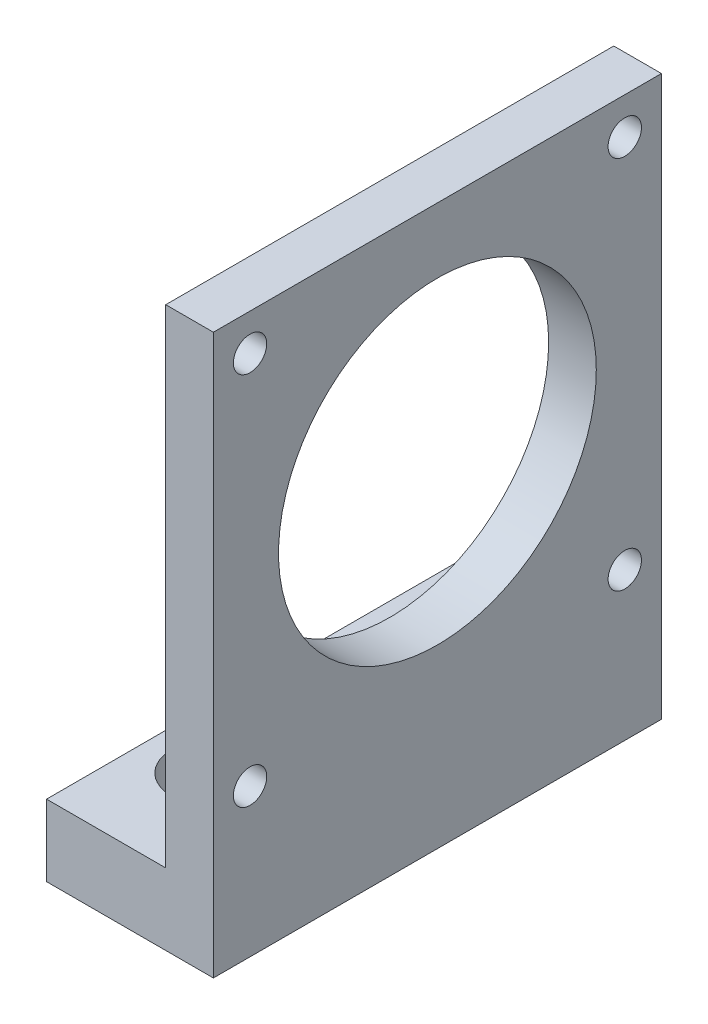
ISO-10303-21;
HEADER;
FILE_DESCRIPTION(('STEP AP214'),'2;1');
FILE_NAME('part.step','',(''),(''),'','','');
FILE_SCHEMA(('AUTOMOTIVE_DESIGN { 1 0 10303 214 1 1 1 1 }'));
ENDSEC;
DATA;
#1=APPLICATION_CONTEXT('core data for automotive mechanical design processes');
#2=APPLICATION_PROTOCOL_DEFINITION('international standard','automotive_design',2000,#1);
#3=PRODUCT_CONTEXT('',#1,'mechanical');
#4=PRODUCT('Part','Part','',(#3));
#5=PRODUCT_RELATED_PRODUCT_CATEGORY('part','',(#4));
#6=PRODUCT_DEFINITION_FORMATION('','',#4);
#7=PRODUCT_DEFINITION_CONTEXT('part definition',#1,'design');
#8=PRODUCT_DEFINITION('design','',#6,#7);
#9=PRODUCT_DEFINITION_SHAPE('','',#8);
#10=(LENGTH_UNIT() NAMED_UNIT(*) SI_UNIT(.MILLI.,.METRE.));
#11=(NAMED_UNIT(*) PLANE_ANGLE_UNIT() SI_UNIT($,.RADIAN.));
#12=(NAMED_UNIT(*) SI_UNIT($,.STERADIAN.) SOLID_ANGLE_UNIT());
#13=UNCERTAINTY_MEASURE_WITH_UNIT(LENGTH_MEASURE(1.E-05),#10,'distance_accuracy_value','');
#14=(GEOMETRIC_REPRESENTATION_CONTEXT(3) GLOBAL_UNCERTAINTY_ASSIGNED_CONTEXT((#13)) GLOBAL_UNIT_ASSIGNED_CONTEXT((#10,
#11,#12)) REPRESENTATION_CONTEXT('',''));
#15=CARTESIAN_POINT('',(0.,0.,0.));
#16=DIRECTION('',(0.,0.,1.));
#17=DIRECTION('',(1.,0.,0.));
#18=AXIS2_PLACEMENT_3D('',#15,#16,#17);
#19=CARTESIAN_POINT('',(-15.,0.,0.));
#20=DIRECTION('',(1.,0.,0.));
#21=DIRECTION('',(0.,0.,-1.));
#22=AXIS2_PLACEMENT_3D('',#19,#20,#21);
#23=PLANE('',#22);
#24=DIRECTION('',(0.,0.,1.));
#25=VECTOR('',#24,1.);
#26=CARTESIAN_POINT('',(-15.,1.,0.));
#27=LINE('',#26,#25);
#28=CARTESIAN_POINT('',(-15.,1.,0.));
#29=VERTEX_POINT('',#28);
#30=CARTESIAN_POINT('',(-15.,1.,56.4));
#31=VERTEX_POINT('',#30);
#32=EDGE_CURVE('E170',#29,#31,#27,.T.);
#33=ORIENTED_EDGE('',*,*,#32,.F.);
#34=DIRECTION('',(0.,-1.,0.));
#35=VECTOR('',#34,1.);
#36=CARTESIAN_POINT('',(-15.,0.,0.));
#37=LINE('',#36,#35);
#38=CARTESIAN_POINT('',(-15.,-8.,0.));
#39=VERTEX_POINT('',#38);
#40=EDGE_CURVE('E222',#29,#39,#37,.T.);
#41=ORIENTED_EDGE('',*,*,#40,.T.);
#42=DIRECTION('',(0.,0.,-1.));
#43=VECTOR('',#42,1.);
#44=CARTESIAN_POINT('',(-15.,-8.,0.));
#45=LINE('',#44,#43);
#46=CARTESIAN_POINT('',(-15.,-8.,56.4));
#47=VERTEX_POINT('',#46);
#48=EDGE_CURVE('E186',#47,#39,#45,.T.);
#49=ORIENTED_EDGE('',*,*,#48,.F.);
#50=DIRECTION('',(0.,1.,0.));
#51=VECTOR('',#50,1.);
#52=CARTESIAN_POINT('',(-15.,0.,56.4));
#53=LINE('',#52,#51);
#54=EDGE_CURVE('E224',#47,#31,#53,.T.);
#55=ORIENTED_EDGE('',*,*,#54,.T.);
#56=EDGE_LOOP('',(#33,#41,#49,#55));
#57=FACE_BOUND('',#56,.T.);
#58=ADVANCED_FACE('F37',(#57),#23,.F.);
#59=CARTESIAN_POINT('',(0.,0.,56.4));
#60=DIRECTION('',(1.,0.,0.));
#61=DIRECTION('',(0.,0.,-1.));
#62=AXIS2_PLACEMENT_3D('',#59,#60,#61);
#63=PLANE('',#62);
#64=CARTESIAN_POINT('',(0.,34.2,28.2));
#65=DIRECTION('',(1.,0.,0.));
#66=DIRECTION('',(0.,0.,-1.));
#67=AXIS2_PLACEMENT_3D('',#64,#65,#66);
#68=CIRCLE('',#67,20.);
#69=CARTESIAN_POINT('',(0.,34.2,8.19999999999999));
#70=VERTEX_POINT('',#69);
#71=EDGE_CURVE('E195',#70,#70,#68,.T.);
#72=ORIENTED_EDGE('',*,*,#71,.T.);
#73=EDGE_LOOP('',(#72));
#74=FACE_BOUND('',#73,.T.);
#75=CARTESIAN_POINT('',(0.,57.785,51.785));
#76=DIRECTION('',(1.,0.,0.));
#77=DIRECTION('',(0.,0.,-1.));
#78=AXIS2_PLACEMENT_3D('',#75,#76,#77);
#79=CIRCLE('',#78,2.1);
#80=CARTESIAN_POINT('',(0.,57.785,49.685));
#81=VERTEX_POINT('',#80);
#82=EDGE_CURVE('E201',#81,#81,#79,.T.);
#83=ORIENTED_EDGE('',*,*,#82,.T.);
#84=EDGE_LOOP('',(#83));
#85=FACE_BOUND('',#84,.T.);
#86=CARTESIAN_POINT('',(0.,57.785,4.615));
#87=DIRECTION('',(1.,0.,0.));
#88=DIRECTION('',(0.,0.,-1.));
#89=AXIS2_PLACEMENT_3D('',#86,#87,#88);
#90=CIRCLE('',#89,2.1);
#91=CARTESIAN_POINT('',(0.,57.785,2.515));
#92=VERTEX_POINT('',#91);
#93=EDGE_CURVE('E207',#92,#92,#90,.T.);
#94=ORIENTED_EDGE('',*,*,#93,.T.);
#95=EDGE_LOOP('',(#94));
#96=FACE_BOUND('',#95,.T.);
#97=CARTESIAN_POINT('',(0.,10.615,4.615));
#98=DIRECTION('',(1.,0.,0.));
#99=DIRECTION('',(0.,0.,-1.));
#100=AXIS2_PLACEMENT_3D('',#97,#98,#99);
#101=CIRCLE('',#100,2.1);
#102=CARTESIAN_POINT('',(0.,10.615,2.515));
#103=VERTEX_POINT('',#102);
#104=EDGE_CURVE('E213',#103,#103,#101,.T.);
#105=ORIENTED_EDGE('',*,*,#104,.T.);
#106=EDGE_LOOP('',(#105));
#107=FACE_BOUND('',#106,.T.);
#108=CARTESIAN_POINT('',(0.,10.615,51.785));
#109=DIRECTION('',(1.,0.,0.));
#110=DIRECTION('',(0.,0.,-1.));
#111=AXIS2_PLACEMENT_3D('',#108,#109,#110);
#112=CIRCLE('',#111,2.1);
#113=CARTESIAN_POINT('',(0.,10.615,49.685));
#114=VERTEX_POINT('',#113);
#115=EDGE_CURVE('E219',#114,#114,#112,.T.);
#116=ORIENTED_EDGE('',*,*,#115,.T.);
#117=EDGE_LOOP('',(#116));
#118=FACE_BOUND('',#117,.T.);
#119=DIRECTION('',(0.,-1.,0.));
#120=VECTOR('',#119,1.);
#121=CARTESIAN_POINT('',(0.,0.,0.));
#122=LINE('',#121,#120);
#123=CARTESIAN_POINT('',(0.,62.4,0.));
#124=VERTEX_POINT('',#123);
#125=CARTESIAN_POINT('',(0.,1.,0.));
#126=VERTEX_POINT('',#125);
#127=EDGE_CURVE('E227',#124,#126,#122,.T.);
#128=ORIENTED_EDGE('',*,*,#127,.T.);
#129=DIRECTION('',(0.,0.,-1.));
#130=VECTOR('',#129,1.);
#131=CARTESIAN_POINT('',(0.,1.,0.));
#132=LINE('',#131,#130);
#133=CARTESIAN_POINT('',(0.,1.,56.4));
#134=VERTEX_POINT('',#133);
#135=EDGE_CURVE('E175',#134,#126,#132,.T.);
#136=ORIENTED_EDGE('',*,*,#135,.F.);
#137=DIRECTION('',(0.,-1.,0.));
#138=VECTOR('',#137,1.);
#139=CARTESIAN_POINT('',(0.,0.,56.4));
#140=LINE('',#139,#138);
#141=CARTESIAN_POINT('',(0.,62.4,56.4));
#142=VERTEX_POINT('',#141);
#143=EDGE_CURVE('E228',#142,#134,#140,.T.);
#144=ORIENTED_EDGE('',*,*,#143,.F.);
#145=DIRECTION('',(0.,0.,-1.));
#146=VECTOR('',#145,1.);
#147=CARTESIAN_POINT('',(0.,62.4,56.4));
#148=LINE('',#147,#146);
#149=EDGE_CURVE('E235',#142,#124,#148,.T.);
#150=ORIENTED_EDGE('',*,*,#149,.T.);
#151=EDGE_LOOP('',(#128,#136,#144,#150));
#152=FACE_BOUND('',#151,.T.);
#153=ADVANCED_FACE('F39',(#74,#85,#96,#107,#118,#152),#63,.F.);
#154=CARTESIAN_POINT('',(6.,0.,56.4));
#155=DIRECTION('',(-1.,0.,0.));
#156=DIRECTION('',(0.,0.,1.));
#157=AXIS2_PLACEMENT_3D('',#154,#155,#156);
#158=PLANE('',#157);
#159=CARTESIAN_POINT('',(6.,34.2,28.2));
#160=DIRECTION('',(1.,0.,0.));
#161=DIRECTION('',(0.,0.,-1.));
#162=AXIS2_PLACEMENT_3D('',#159,#160,#161);
#163=CIRCLE('',#162,20.);
#164=CARTESIAN_POINT('',(6.,34.2,8.19999999999999));
#165=VERTEX_POINT('',#164);
#166=EDGE_CURVE('E192',#165,#165,#163,.T.);
#167=ORIENTED_EDGE('',*,*,#166,.F.);
#168=EDGE_LOOP('',(#167));
#169=FACE_BOUND('',#168,.T.);
#170=CARTESIAN_POINT('',(6.,57.785,51.785));
#171=DIRECTION('',(1.,0.,0.));
#172=DIRECTION('',(0.,0.,-1.));
#173=AXIS2_PLACEMENT_3D('',#170,#171,#172);
#174=CIRCLE('',#173,2.1);
#175=CARTESIAN_POINT('',(6.,57.785,49.685));
#176=VERTEX_POINT('',#175);
#177=EDGE_CURVE('E198',#176,#176,#174,.T.);
#178=ORIENTED_EDGE('',*,*,#177,.F.);
#179=EDGE_LOOP('',(#178));
#180=FACE_BOUND('',#179,.T.);
#181=CARTESIAN_POINT('',(6.,57.785,4.615));
#182=DIRECTION('',(1.,0.,0.));
#183=DIRECTION('',(0.,0.,-1.));
#184=AXIS2_PLACEMENT_3D('',#181,#182,#183);
#185=CIRCLE('',#184,2.1);
#186=CARTESIAN_POINT('',(6.,57.785,2.515));
#187=VERTEX_POINT('',#186);
#188=EDGE_CURVE('E204',#187,#187,#185,.T.);
#189=ORIENTED_EDGE('',*,*,#188,.F.);
#190=EDGE_LOOP('',(#189));
#191=FACE_BOUND('',#190,.T.);
#192=CARTESIAN_POINT('',(6.,10.615,4.615));
#193=DIRECTION('',(1.,0.,0.));
#194=DIRECTION('',(0.,0.,-1.));
#195=AXIS2_PLACEMENT_3D('',#192,#193,#194);
#196=CIRCLE('',#195,2.1);
#197=CARTESIAN_POINT('',(6.,10.615,2.515));
#198=VERTEX_POINT('',#197);
#199=EDGE_CURVE('E210',#198,#198,#196,.T.);
#200=ORIENTED_EDGE('',*,*,#199,.F.);
#201=EDGE_LOOP('',(#200));
#202=FACE_BOUND('',#201,.T.);
#203=CARTESIAN_POINT('',(6.,10.615,51.785));
#204=DIRECTION('',(1.,0.,0.));
#205=DIRECTION('',(0.,0.,-1.));
#206=AXIS2_PLACEMENT_3D('',#203,#204,#205);
#207=CIRCLE('',#206,2.1);
#208=CARTESIAN_POINT('',(6.,10.615,49.685));
#209=VERTEX_POINT('',#208);
#210=EDGE_CURVE('E216',#209,#209,#207,.T.);
#211=ORIENTED_EDGE('',*,*,#210,.F.);
#212=EDGE_LOOP('',(#211));
#213=FACE_BOUND('',#212,.T.);
#214=DIRECTION('',(0.,1.,0.));
#215=VECTOR('',#214,1.);
#216=CARTESIAN_POINT('',(6.,0.,0.));
#217=LINE('',#216,#215);
#218=CARTESIAN_POINT('',(6.,-8.,0.));
#219=VERTEX_POINT('',#218);
#220=CARTESIAN_POINT('',(6.,62.4,0.));
#221=VERTEX_POINT('',#220);
#222=EDGE_CURVE('E237',#219,#221,#217,.T.);
#223=ORIENTED_EDGE('',*,*,#222,.T.);
#224=DIRECTION('',(0.,0.,-1.));
#225=VECTOR('',#224,1.);
#226=CARTESIAN_POINT('',(6.,62.4,56.4));
#227=LINE('',#226,#225);
#228=CARTESIAN_POINT('',(6.,62.4,56.4));
#229=VERTEX_POINT('',#228);
#230=EDGE_CURVE('E242',#229,#221,#227,.T.);
#231=ORIENTED_EDGE('',*,*,#230,.F.);
#232=DIRECTION('',(0.,1.,0.));
#233=VECTOR('',#232,1.);
#234=CARTESIAN_POINT('',(6.,0.,56.4));
#235=LINE('',#234,#233);
#236=CARTESIAN_POINT('',(6.,-8.,56.4));
#237=VERTEX_POINT('',#236);
#238=EDGE_CURVE('E230',#237,#229,#235,.T.);
#239=ORIENTED_EDGE('',*,*,#238,.F.);
#240=DIRECTION('',(0.,0.,1.));
#241=VECTOR('',#240,1.);
#242=CARTESIAN_POINT('',(6.,-8.,0.));
#243=LINE('',#242,#241);
#244=EDGE_CURVE('E180',#219,#237,#243,.T.);
#245=ORIENTED_EDGE('',*,*,#244,.F.);
#246=EDGE_LOOP('',(#223,#231,#239,#245));
#247=FACE_BOUND('',#246,.T.);
#248=ADVANCED_FACE('F316',(#169,#180,#191,#202,#213,#247),#158,.F.);
#249=CARTESIAN_POINT('',(0.,62.4,56.4));
#250=DIRECTION('',(0.,-1.,0.));
#251=DIRECTION('',(0.,0.,-1.));
#252=AXIS2_PLACEMENT_3D('',#249,#250,#251);
#253=PLANE('',#252);
#254=DIRECTION('',(-1.,0.,0.));
#255=VECTOR('',#254,1.);
#256=CARTESIAN_POINT('',(0.,62.4,0.));
#257=LINE('',#256,#255);
#258=EDGE_CURVE('E231',#221,#124,#257,.T.);
#259=ORIENTED_EDGE('',*,*,#258,.T.);
#260=ORIENTED_EDGE('',*,*,#149,.F.);
#261=DIRECTION('',(-1.,0.,0.));
#262=VECTOR('',#261,1.);
#263=CARTESIAN_POINT('',(0.,62.4,56.4));
#264=LINE('',#263,#262);
#265=EDGE_CURVE('E233',#229,#142,#264,.T.);
#266=ORIENTED_EDGE('',*,*,#265,.F.);
#267=ORIENTED_EDGE('',*,*,#230,.T.);
#268=EDGE_LOOP('',(#259,#260,#266,#267));
#269=FACE_BOUND('',#268,.T.);
#270=ADVANCED_FACE('F327',(#269),#253,.F.);
#271=CARTESIAN_POINT('',(0.,0.,56.4));
#272=DIRECTION('',(0.,0.,-1.));
#273=DIRECTION('',(-1.,0.,0.));
#274=AXIS2_PLACEMENT_3D('',#271,#272,#273);
#275=PLANE('',#274);
#276=ORIENTED_EDGE('',*,*,#143,.T.);
#277=DIRECTION('',(1.,0.,0.));
#278=VECTOR('',#277,1.);
#279=CARTESIAN_POINT('',(-15.,1.,56.4));
#280=LINE('',#279,#278);
#281=EDGE_CURVE('E172',#31,#134,#280,.T.);
#282=ORIENTED_EDGE('',*,*,#281,.F.);
#283=ORIENTED_EDGE('',*,*,#54,.F.);
#284=DIRECTION('',(-1.,0.,0.));
#285=VECTOR('',#284,1.);
#286=CARTESIAN_POINT('',(6.,-8.,56.4));
#287=LINE('',#286,#285);
#288=EDGE_CURVE('E183',#237,#47,#287,.T.);
#289=ORIENTED_EDGE('',*,*,#288,.F.);
#290=ORIENTED_EDGE('',*,*,#238,.T.);
#291=ORIENTED_EDGE('',*,*,#265,.T.);
#292=EDGE_LOOP('',(#276,#282,#283,#289,#290,#291));
#293=FACE_BOUND('',#292,.T.);
#294=ADVANCED_FACE('F323',(#293),#275,.F.);
#295=CARTESIAN_POINT('',(0.,0.,0.));
#296=DIRECTION('',(0.,0.,-1.));
#297=DIRECTION('',(-1.,0.,0.));
#298=AXIS2_PLACEMENT_3D('',#295,#296,#297);
#299=PLANE('',#298);
#300=DIRECTION('',(-1.,0.,0.));
#301=VECTOR('',#300,1.);
#302=CARTESIAN_POINT('',(-15.,1.,0.));
#303=LINE('',#302,#301);
#304=EDGE_CURVE('E178',#126,#29,#303,.T.);
#305=ORIENTED_EDGE('',*,*,#304,.F.);
#306=ORIENTED_EDGE('',*,*,#127,.F.);
#307=ORIENTED_EDGE('',*,*,#258,.F.);
#308=ORIENTED_EDGE('',*,*,#222,.F.);
#309=DIRECTION('',(1.,0.,0.));
#310=VECTOR('',#309,1.);
#311=CARTESIAN_POINT('',(6.,-8.,0.));
#312=LINE('',#311,#310);
#313=EDGE_CURVE('E189',#39,#219,#312,.T.);
#314=ORIENTED_EDGE('',*,*,#313,.F.);
#315=ORIENTED_EDGE('',*,*,#40,.F.);
#316=EDGE_LOOP('',(#305,#306,#307,#308,#314,#315));
#317=FACE_BOUND('',#316,.T.);
#318=ADVANCED_FACE('F326',(#317),#299,.T.);
#319=CARTESIAN_POINT('',(6.,10.615,51.785));
#320=DIRECTION('',(1.,0.,0.));
#321=DIRECTION('',(0.,0.,-1.));
#322=AXIS2_PLACEMENT_3D('',#319,#320,#321);
#323=CYLINDRICAL_SURFACE('',#322,2.1);
#324=ORIENTED_EDGE('',*,*,#210,.T.);
#325=EDGE_LOOP('',(#324));
#326=FACE_BOUND('',#325,.T.);
#327=ORIENTED_EDGE('',*,*,#115,.F.);
#328=EDGE_LOOP('',(#327));
#329=FACE_BOUND('',#328,.T.);
#330=ADVANCED_FACE('F321',(#326,#329),#323,.F.);
#331=CARTESIAN_POINT('',(6.,10.615,4.615));
#332=DIRECTION('',(1.,0.,0.));
#333=DIRECTION('',(0.,0.,-1.));
#334=AXIS2_PLACEMENT_3D('',#331,#332,#333);
#335=CYLINDRICAL_SURFACE('',#334,2.1);
#336=ORIENTED_EDGE('',*,*,#199,.T.);
#337=EDGE_LOOP('',(#336));
#338=FACE_BOUND('',#337,.T.);
#339=ORIENTED_EDGE('',*,*,#104,.F.);
#340=EDGE_LOOP('',(#339));
#341=FACE_BOUND('',#340,.T.);
#342=ADVANCED_FACE('F380',(#338,#341),#335,.F.);
#343=CARTESIAN_POINT('',(6.,57.785,4.615));
#344=DIRECTION('',(1.,0.,0.));
#345=DIRECTION('',(0.,0.,-1.));
#346=AXIS2_PLACEMENT_3D('',#343,#344,#345);
#347=CYLINDRICAL_SURFACE('',#346,2.1);
#348=ORIENTED_EDGE('',*,*,#188,.T.);
#349=EDGE_LOOP('',(#348));
#350=FACE_BOUND('',#349,.T.);
#351=ORIENTED_EDGE('',*,*,#93,.F.);
#352=EDGE_LOOP('',(#351));
#353=FACE_BOUND('',#352,.T.);
#354=ADVANCED_FACE('F377',(#350,#353),#347,.F.);
#355=CARTESIAN_POINT('',(6.,57.785,51.785));
#356=DIRECTION('',(1.,0.,0.));
#357=DIRECTION('',(0.,0.,-1.));
#358=AXIS2_PLACEMENT_3D('',#355,#356,#357);
#359=CYLINDRICAL_SURFACE('',#358,2.1);
#360=ORIENTED_EDGE('',*,*,#177,.T.);
#361=EDGE_LOOP('',(#360));
#362=FACE_BOUND('',#361,.T.);
#363=ORIENTED_EDGE('',*,*,#82,.F.);
#364=EDGE_LOOP('',(#363));
#365=FACE_BOUND('',#364,.T.);
#366=ADVANCED_FACE('F370',(#362,#365),#359,.F.);
#367=CARTESIAN_POINT('',(-9.,34.2,28.2));
#368=DIRECTION('',(1.,0.,0.));
#369=DIRECTION('',(0.,0.,-1.));
#370=AXIS2_PLACEMENT_3D('',#367,#368,#369);
#371=CYLINDRICAL_SURFACE('',#370,20.);
#372=ORIENTED_EDGE('',*,*,#166,.T.);
#373=EDGE_LOOP('',(#372));
#374=FACE_BOUND('',#373,.T.);
#375=ORIENTED_EDGE('',*,*,#71,.F.);
#376=EDGE_LOOP('',(#375));
#377=FACE_BOUND('',#376,.T.);
#378=ADVANCED_FACE('F363',(#374,#377),#371,.F.);
#379=CARTESIAN_POINT('',(0.,-8.,0.));
#380=DIRECTION('',(0.,-1.,0.));
#381=DIRECTION('',(0.,0.,-1.));
#382=AXIS2_PLACEMENT_3D('',#379,#380,#381);
#383=PLANE('',#382);
#384=DIRECTION('',(0.,0.,1.));
#385=VECTOR('',#384,1.);
#386=CARTESIAN_POINT('',(-4.75,-8.,0.));
#387=LINE('',#386,#385);
#388=CARTESIAN_POINT('',(-4.75,-8.,13.2));
#389=VERTEX_POINT('',#388);
#390=CARTESIAN_POINT('',(-4.75,-8.,43.2));
#391=VERTEX_POINT('',#390);
#392=EDGE_CURVE('E255',#389,#391,#387,.T.);
#393=ORIENTED_EDGE('',*,*,#392,.F.);
#394=CARTESIAN_POINT('',(-7.5,-8.,13.2));
#395=DIRECTION('',(0.,-1.,0.));
#396=DIRECTION('',(0.,0.,-1.));
#397=AXIS2_PLACEMENT_3D('',#394,#395,#396);
#398=CIRCLE('',#397,2.75);
#399=CARTESIAN_POINT('',(-10.25,-8.,13.2));
#400=VERTEX_POINT('',#399);
#401=EDGE_CURVE('E153',#400,#389,#398,.T.);
#402=ORIENTED_EDGE('',*,*,#401,.F.);
#403=DIRECTION('',(0.,0.,-1.));
#404=VECTOR('',#403,1.);
#405=CARTESIAN_POINT('',(-10.25,-8.,0.));
#406=LINE('',#405,#404);
#407=CARTESIAN_POINT('',(-10.25,-8.,43.2));
#408=VERTEX_POINT('',#407);
#409=EDGE_CURVE('E60',#408,#400,#406,.T.);
#410=ORIENTED_EDGE('',*,*,#409,.F.);
#411=CARTESIAN_POINT('',(-7.49999999999999,-8.,43.2));
#412=DIRECTION('',(0.,-1.,0.));
#413=DIRECTION('',(0.,0.,-1.));
#414=AXIS2_PLACEMENT_3D('',#411,#412,#413);
#415=CIRCLE('',#414,2.75);
#416=EDGE_CURVE('E169',#391,#408,#415,.T.);
#417=ORIENTED_EDGE('',*,*,#416,.F.);
#418=EDGE_LOOP('',(#393,#402,#410,#417));
#419=FACE_BOUND('',#418,.T.);
#420=ORIENTED_EDGE('',*,*,#244,.T.);
#421=ORIENTED_EDGE('',*,*,#288,.T.);
#422=ORIENTED_EDGE('',*,*,#48,.T.);
#423=ORIENTED_EDGE('',*,*,#313,.T.);
#424=EDGE_LOOP('',(#420,#421,#422,#423));
#425=FACE_BOUND('',#424,.T.);
#426=ADVANCED_FACE('F253',(#419,#425),#383,.T.);
#427=CARTESIAN_POINT('',(0.,1.,0.));
#428=DIRECTION('',(0.,1.,0.));
#429=DIRECTION('',(0.,0.,1.));
#430=AXIS2_PLACEMENT_3D('',#427,#428,#429);
#431=PLANE('',#430);
#432=DIRECTION('',(0.,0.,1.));
#433=VECTOR('',#432,1.);
#434=CARTESIAN_POINT('',(-12.5,1.,13.2));
#435=LINE('',#434,#433);
#436=CARTESIAN_POINT('',(-12.5,1.,13.2));
#437=VERTEX_POINT('',#436);
#438=CARTESIAN_POINT('',(-12.5,1.,43.2));
#439=VERTEX_POINT('',#438);
#440=EDGE_CURVE('E262',#437,#439,#435,.T.);
#441=ORIENTED_EDGE('',*,*,#440,.F.);
#442=CARTESIAN_POINT('',(-7.5,1.,13.2));
#443=DIRECTION('',(0.,1.,0.));
#444=DIRECTION('',(0.,0.,1.));
#445=AXIS2_PLACEMENT_3D('',#442,#443,#444);
#446=CIRCLE('',#445,4.99999999999999);
#447=CARTESIAN_POINT('',(-2.5,1.,13.2));
#448=VERTEX_POINT('',#447);
#449=EDGE_CURVE('E159',#448,#437,#446,.T.);
#450=ORIENTED_EDGE('',*,*,#449,.F.);
#451=DIRECTION('',(0.,0.,-1.));
#452=VECTOR('',#451,1.);
#453=CARTESIAN_POINT('',(-2.5,1.,13.2));
#454=LINE('',#453,#452);
#455=CARTESIAN_POINT('',(-2.5,1.,43.2));
#456=VERTEX_POINT('',#455);
#457=EDGE_CURVE('E257',#456,#448,#454,.T.);
#458=ORIENTED_EDGE('',*,*,#457,.F.);
#459=CARTESIAN_POINT('',(-7.49999999999999,1.,43.2));
#460=DIRECTION('',(0.,1.,0.));
#461=DIRECTION('',(0.,0.,1.));
#462=AXIS2_PLACEMENT_3D('',#459,#460,#461);
#463=CIRCLE('',#462,4.99999999999999);
#464=EDGE_CURVE('E156',#439,#456,#463,.T.);
#465=ORIENTED_EDGE('',*,*,#464,.F.);
#466=EDGE_LOOP('',(#441,#450,#458,#465));
#467=FACE_BOUND('',#466,.T.);
#468=ORIENTED_EDGE('',*,*,#32,.T.);
#469=ORIENTED_EDGE('',*,*,#281,.T.);
#470=ORIENTED_EDGE('',*,*,#135,.T.);
#471=ORIENTED_EDGE('',*,*,#304,.T.);
#472=EDGE_LOOP('',(#468,#469,#470,#471));
#473=FACE_BOUND('',#472,.T.);
#474=ADVANCED_FACE('F289',(#467,#473),#431,.T.);
#475=CARTESIAN_POINT('',(-7.49999999999999,1.,43.2));
#476=DIRECTION('',(0.,1.,0.));
#477=DIRECTION('',(0.,0.,1.));
#478=AXIS2_PLACEMENT_3D('',#475,#476,#477);
#479=CYLINDRICAL_SURFACE('',#478,2.75);
#480=CARTESIAN_POINT('',(-7.49999999999999,-4.4,43.2));
#481=DIRECTION('',(0.,1.,0.));
#482=DIRECTION('',(0.,0.,1.));
#483=AXIS2_PLACEMENT_3D('',#480,#481,#482);
#484=CIRCLE('',#483,2.75);
#485=CARTESIAN_POINT('',(-10.25,-4.4,43.2));
#486=VERTEX_POINT('',#485);
#487=CARTESIAN_POINT('',(-4.75,-4.4,43.2));
#488=VERTEX_POINT('',#487);
#489=EDGE_CURVE('E149',#486,#488,#484,.T.);
#490=ORIENTED_EDGE('',*,*,#489,.T.);
#491=DIRECTION('',(0.,1.,0.));
#492=VECTOR('',#491,1.);
#493=CARTESIAN_POINT('',(-4.75,-14.4,43.2));
#494=LINE('',#493,#492);
#495=EDGE_CURVE('E250',#391,#488,#494,.T.);
#496=ORIENTED_EDGE('',*,*,#495,.F.);
#497=ORIENTED_EDGE('',*,*,#416,.T.);
#498=DIRECTION('',(0.,1.,0.));
#499=VECTOR('',#498,1.);
#500=CARTESIAN_POINT('',(-10.25,-14.4,43.2));
#501=LINE('',#500,#499);
#502=EDGE_CURVE('E150',#408,#486,#501,.T.);
#503=ORIENTED_EDGE('',*,*,#502,.T.);
#504=EDGE_LOOP('',(#490,#496,#497,#503));
#505=FACE_BOUND('',#504,.T.);
#506=ADVANCED_FACE('F249',(#505),#479,.F.);
#507=CARTESIAN_POINT('',(-4.75,-4.4,43.2));
#508=DIRECTION('',(0.,-1.,0.));
#509=DIRECTION('',(0.,0.,-1.));
#510=AXIS2_PLACEMENT_3D('',#507,#508,#509);
#511=PLANE('',#510);
#512=CARTESIAN_POINT('',(-7.5,-4.4,13.2));
#513=DIRECTION('',(0.,1.,0.));
#514=DIRECTION('',(0.,0.,1.));
#515=AXIS2_PLACEMENT_3D('',#512,#513,#514);
#516=CIRCLE('',#515,2.75);
#517=CARTESIAN_POINT('',(-4.75,-4.4,13.2));
#518=VERTEX_POINT('',#517);
#519=CARTESIAN_POINT('',(-10.25,-4.4,13.2));
#520=VERTEX_POINT('',#519);
#521=EDGE_CURVE('E147',#518,#520,#516,.T.);
#522=ORIENTED_EDGE('',*,*,#521,.F.);
#523=DIRECTION('',(0.,0.,-1.));
#524=VECTOR('',#523,1.);
#525=CARTESIAN_POINT('',(-4.75,-4.4,13.2));
#526=LINE('',#525,#524);
#527=EDGE_CURVE('E52',#488,#518,#526,.T.);
#528=ORIENTED_EDGE('',*,*,#527,.F.);
#529=ORIENTED_EDGE('',*,*,#489,.F.);
#530=DIRECTION('',(0.,0.,1.));
#531=VECTOR('',#530,1.);
#532=CARTESIAN_POINT('',(-10.25,-4.4,13.2));
#533=LINE('',#532,#531);
#534=EDGE_CURVE('E136',#520,#486,#533,.T.);
#535=ORIENTED_EDGE('',*,*,#534,.F.);
#536=EDGE_LOOP('',(#522,#528,#529,#535));
#537=FACE_BOUND('',#536,.T.);
#538=CARTESIAN_POINT('',(-7.49999999999999,-4.4,43.2));
#539=DIRECTION('',(0.,1.,0.));
#540=DIRECTION('',(0.,0.,1.));
#541=AXIS2_PLACEMENT_3D('',#538,#539,#540);
#542=CIRCLE('',#541,4.99999999999999);
#543=CARTESIAN_POINT('',(-12.5,-4.4,43.2));
#544=VERTEX_POINT('',#543);
#545=CARTESIAN_POINT('',(-2.5,-4.4,43.2));
#546=VERTEX_POINT('',#545);
#547=EDGE_CURVE('E165',#544,#546,#542,.T.);
#548=ORIENTED_EDGE('',*,*,#547,.T.);
#549=DIRECTION('',(0.,0.,-1.));
#550=VECTOR('',#549,1.);
#551=CARTESIAN_POINT('',(-2.5,-4.4,13.2));
#552=LINE('',#551,#550);
#553=CARTESIAN_POINT('',(-2.5,-4.4,13.2));
#554=VERTEX_POINT('',#553);
#555=EDGE_CURVE('E266',#546,#554,#552,.T.);
#556=ORIENTED_EDGE('',*,*,#555,.T.);
#557=CARTESIAN_POINT('',(-7.5,-4.4,13.2));
#558=DIRECTION('',(0.,1.,0.));
#559=DIRECTION('',(0.,0.,1.));
#560=AXIS2_PLACEMENT_3D('',#557,#558,#559);
#561=CIRCLE('',#560,4.99999999999999);
#562=CARTESIAN_POINT('',(-12.5,-4.4,13.2));
#563=VERTEX_POINT('',#562);
#564=EDGE_CURVE('E154',#554,#563,#561,.T.);
#565=ORIENTED_EDGE('',*,*,#564,.T.);
#566=DIRECTION('',(0.,0.,1.));
#567=VECTOR('',#566,1.);
#568=CARTESIAN_POINT('',(-12.5,-4.4,13.2));
#569=LINE('',#568,#567);
#570=EDGE_CURVE('E270',#563,#544,#569,.T.);
#571=ORIENTED_EDGE('',*,*,#570,.T.);
#572=EDGE_LOOP('',(#548,#556,#565,#571));
#573=FACE_BOUND('',#572,.T.);
#574=ADVANCED_FACE('F145',(#537,#573),#511,.F.);
#575=CARTESIAN_POINT('',(-7.49999999999999,1.,43.2));
#576=DIRECTION('',(0.,1.,0.));
#577=DIRECTION('',(0.,0.,1.));
#578=AXIS2_PLACEMENT_3D('',#575,#576,#577);
#579=CYLINDRICAL_SURFACE('',#578,4.99999999999999);
#580=ORIENTED_EDGE('',*,*,#547,.F.);
#581=DIRECTION('',(0.,1.,0.));
#582=VECTOR('',#581,1.);
#583=CARTESIAN_POINT('',(-12.5,-36.0227766016838,43.2));
#584=LINE('',#583,#582);
#585=EDGE_CURVE('E273',#544,#439,#584,.T.);
#586=ORIENTED_EDGE('',*,*,#585,.T.);
#587=ORIENTED_EDGE('',*,*,#464,.T.);
#588=DIRECTION('',(0.,1.,0.));
#589=VECTOR('',#588,1.);
#590=CARTESIAN_POINT('',(-2.5,-36.0227766016838,43.2));
#591=LINE('',#590,#589);
#592=EDGE_CURVE('E269',#546,#456,#591,.T.);
#593=ORIENTED_EDGE('',*,*,#592,.F.);
#594=EDGE_LOOP('',(#580,#586,#587,#593));
#595=FACE_BOUND('',#594,.T.);
#596=ADVANCED_FACE('F296',(#595),#579,.F.);
#597=CARTESIAN_POINT('',(-7.5,1.,13.2));
#598=DIRECTION('',(0.,1.,0.));
#599=DIRECTION('',(0.,0.,1.));
#600=AXIS2_PLACEMENT_3D('',#597,#598,#599);
#601=CYLINDRICAL_SURFACE('',#600,2.75);
#602=ORIENTED_EDGE('',*,*,#521,.T.);
#603=DIRECTION('',(0.,1.,0.));
#604=VECTOR('',#603,1.);
#605=CARTESIAN_POINT('',(-10.25,1.,13.2));
#606=LINE('',#605,#604);
#607=EDGE_CURVE('E11',#520,#400,#606,.F.);
#608=ORIENTED_EDGE('',*,*,#607,.T.);
#609=ORIENTED_EDGE('',*,*,#401,.T.);
#610=DIRECTION('',(0.,1.,0.));
#611=VECTOR('',#610,1.);
#612=CARTESIAN_POINT('',(-4.75,1.,13.2));
#613=LINE('',#612,#611);
#614=EDGE_CURVE('E45',#389,#518,#613,.T.);
#615=ORIENTED_EDGE('',*,*,#614,.T.);
#616=EDGE_LOOP('',(#602,#608,#609,#615));
#617=FACE_BOUND('',#616,.T.);
#618=ADVANCED_FACE('F152',(#617),#601,.F.);
#619=CARTESIAN_POINT('',(-7.5,1.,13.2));
#620=DIRECTION('',(0.,1.,0.));
#621=DIRECTION('',(0.,0.,1.));
#622=AXIS2_PLACEMENT_3D('',#619,#620,#621);
#623=CYLINDRICAL_SURFACE('',#622,4.99999999999999);
#624=ORIENTED_EDGE('',*,*,#449,.T.);
#625=DIRECTION('',(0.,1.,0.));
#626=VECTOR('',#625,1.);
#627=CARTESIAN_POINT('',(-12.5,-36.0227766016838,13.2));
#628=LINE('',#627,#626);
#629=EDGE_CURVE('E264',#563,#437,#628,.T.);
#630=ORIENTED_EDGE('',*,*,#629,.F.);
#631=ORIENTED_EDGE('',*,*,#564,.F.);
#632=DIRECTION('',(0.,1.,0.));
#633=VECTOR('',#632,1.);
#634=CARTESIAN_POINT('',(-2.5,-36.0227766016838,13.2));
#635=LINE('',#634,#633);
#636=EDGE_CURVE('E268',#554,#448,#635,.T.);
#637=ORIENTED_EDGE('',*,*,#636,.T.);
#638=EDGE_LOOP('',(#624,#630,#631,#637));
#639=FACE_BOUND('',#638,.T.);
#640=ADVANCED_FACE('F283',(#639),#623,.F.);
#641=CARTESIAN_POINT('',(-12.5,-36.0227766016838,13.2));
#642=DIRECTION('',(-1.,0.,0.));
#643=DIRECTION('',(0.,0.,1.));
#644=AXIS2_PLACEMENT_3D('',#641,#642,#643);
#645=PLANE('',#644);
#646=ORIENTED_EDGE('',*,*,#629,.T.);
#647=ORIENTED_EDGE('',*,*,#440,.T.);
#648=ORIENTED_EDGE('',*,*,#585,.F.);
#649=ORIENTED_EDGE('',*,*,#570,.F.);
#650=EDGE_LOOP('',(#646,#647,#648,#649));
#651=FACE_BOUND('',#650,.T.);
#652=ADVANCED_FACE('F293',(#651),#645,.F.);
#653=CARTESIAN_POINT('',(-2.5,-36.0227766016838,13.2));
#654=DIRECTION('',(1.,0.,0.));
#655=DIRECTION('',(0.,0.,-1.));
#656=AXIS2_PLACEMENT_3D('',#653,#654,#655);
#657=PLANE('',#656);
#658=ORIENTED_EDGE('',*,*,#592,.T.);
#659=ORIENTED_EDGE('',*,*,#457,.T.);
#660=ORIENTED_EDGE('',*,*,#636,.F.);
#661=ORIENTED_EDGE('',*,*,#555,.F.);
#662=EDGE_LOOP('',(#658,#659,#660,#661));
#663=FACE_BOUND('',#662,.T.);
#664=ADVANCED_FACE('F299',(#663),#657,.F.);
#665=CARTESIAN_POINT('',(-4.75,-14.4,13.2));
#666=DIRECTION('',(1.,0.,0.));
#667=DIRECTION('',(0.,0.,-1.));
#668=AXIS2_PLACEMENT_3D('',#665,#666,#667);
#669=PLANE('',#668);
#670=ORIENTED_EDGE('',*,*,#392,.T.);
#671=ORIENTED_EDGE('',*,*,#495,.T.);
#672=ORIENTED_EDGE('',*,*,#527,.T.);
#673=ORIENTED_EDGE('',*,*,#614,.F.);
#674=EDGE_LOOP('',(#670,#671,#672,#673));
#675=FACE_BOUND('',#674,.T.);
#676=ADVANCED_FACE('F301',(#675),#669,.F.);
#677=CARTESIAN_POINT('',(-10.25,-14.4,13.2));
#678=DIRECTION('',(-1.,0.,0.));
#679=DIRECTION('',(0.,0.,1.));
#680=AXIS2_PLACEMENT_3D('',#677,#678,#679);
#681=PLANE('',#680);
#682=ORIENTED_EDGE('',*,*,#409,.T.);
#683=ORIENTED_EDGE('',*,*,#607,.F.);
#684=ORIENTED_EDGE('',*,*,#534,.T.);
#685=ORIENTED_EDGE('',*,*,#502,.F.);
#686=EDGE_LOOP('',(#682,#683,#684,#685));
#687=FACE_BOUND('',#686,.T.);
#688=ADVANCED_FACE('F135',(#687),#681,.F.);
#689=CLOSED_SHELL('',(#58,#153,#248,#270,#294,#318,#330,#342,#354,#366,#378,#426,#474,#506,#574,
#596,#618,#640,#652,#664,#676,#688));
#690=MANIFOLD_SOLID_BREP('B2',#689);
#691=ADVANCED_BREP_SHAPE_REPRESENTATION('',(#18,#690),#14);
#692=SHAPE_DEFINITION_REPRESENTATION(#9,#691);
ENDSEC;
END-ISO-10303-21;
